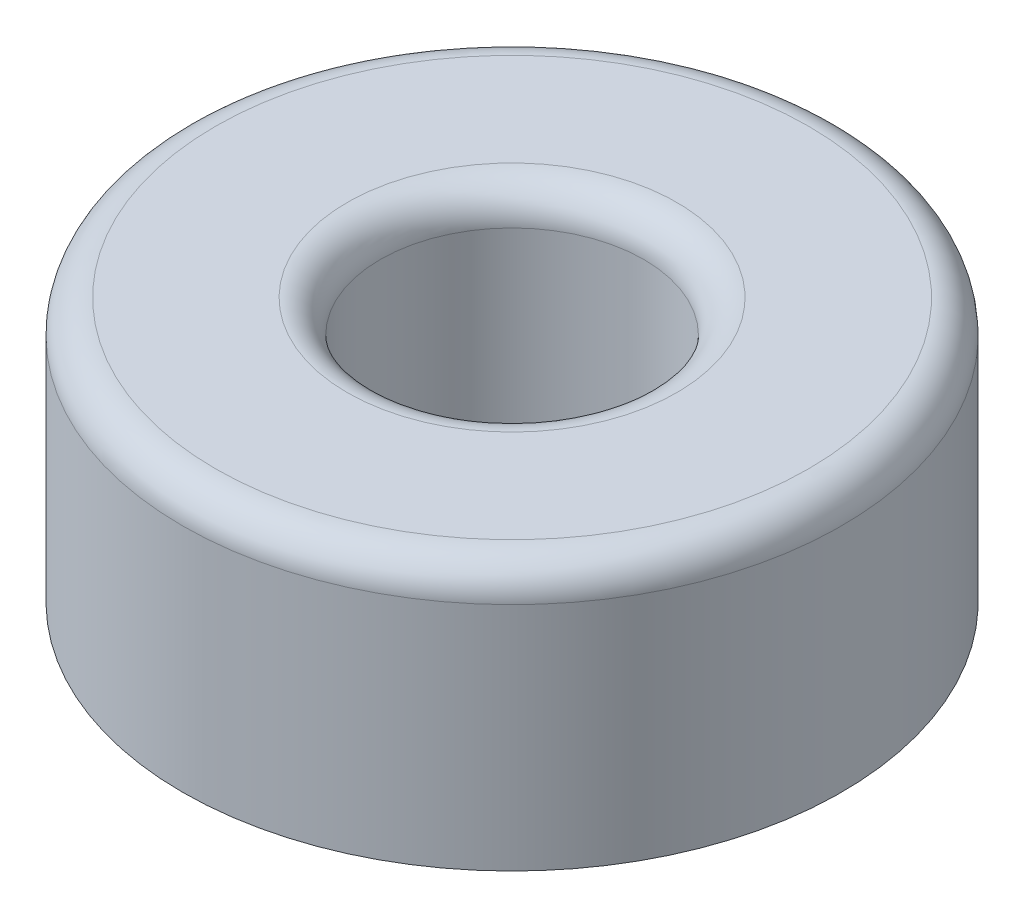
ISO-10303-21;
HEADER;
FILE_DESCRIPTION(('STEP AP214'),'2;1');
FILE_NAME('part.step','',(''),(''),'','','');
FILE_SCHEMA(('AUTOMOTIVE_DESIGN { 1 0 10303 214 1 1 1 1 }'));
ENDSEC;
DATA;
#1=APPLICATION_CONTEXT('core data for automotive mechanical design processes');
#2=APPLICATION_PROTOCOL_DEFINITION('international standard','automotive_design',2000,#1);
#3=PRODUCT_CONTEXT('',#1,'mechanical');
#4=PRODUCT('Part','Part','',(#3));
#5=PRODUCT_RELATED_PRODUCT_CATEGORY('part','',(#4));
#6=PRODUCT_DEFINITION_FORMATION('','',#4);
#7=PRODUCT_DEFINITION_CONTEXT('part definition',#1,'design');
#8=PRODUCT_DEFINITION('design','',#6,#7);
#9=PRODUCT_DEFINITION_SHAPE('','',#8);
#10=(LENGTH_UNIT() NAMED_UNIT(*) SI_UNIT(.MILLI.,.METRE.));
#11=(NAMED_UNIT(*) PLANE_ANGLE_UNIT() SI_UNIT($,.RADIAN.));
#12=(NAMED_UNIT(*) SI_UNIT($,.STERADIAN.) SOLID_ANGLE_UNIT());
#13=UNCERTAINTY_MEASURE_WITH_UNIT(LENGTH_MEASURE(1.E-05),#10,'distance_accuracy_value','');
#14=(GEOMETRIC_REPRESENTATION_CONTEXT(3) GLOBAL_UNCERTAINTY_ASSIGNED_CONTEXT((#13)) GLOBAL_UNIT_ASSIGNED_CONTEXT((#10,
#11,#12)) REPRESENTATION_CONTEXT('',''));
#15=CARTESIAN_POINT('',(0.,0.,0.));
#16=DIRECTION('',(0.,0.,1.));
#17=DIRECTION('',(1.,0.,0.));
#18=AXIS2_PLACEMENT_3D('',#15,#16,#17);
#19=CARTESIAN_POINT('',(0.,4.,0.));
#20=DIRECTION('',(0.,1.,0.));
#21=DIRECTION('',(0.,0.,1.));
#22=AXIS2_PLACEMENT_3D('',#19,#20,#21);
#23=PLANE('',#22);
#24=CARTESIAN_POINT('',(0.,4.,0.));
#25=DIRECTION('',(0.,1.,0.));
#26=DIRECTION('',(0.,0.,1.));
#27=AXIS2_PLACEMENT_3D('',#24,#25,#26);
#28=CIRCLE('',#27,2.5);
#29=CARTESIAN_POINT('',(0.,4.,2.5));
#30=VERTEX_POINT('',#29);
#31=EDGE_CURVE('E39',#30,#30,#28,.F.);
#32=ORIENTED_EDGE('',*,*,#31,.T.);
#33=EDGE_LOOP('',(#32));
#34=FACE_BOUND('',#33,.T.);
#35=CARTESIAN_POINT('',(0.,4.,0.));
#36=DIRECTION('',(0.,1.,0.));
#37=DIRECTION('',(0.,0.,1.));
#38=AXIS2_PLACEMENT_3D('',#35,#36,#37);
#39=CIRCLE('',#38,4.5);
#40=CARTESIAN_POINT('',(0.,4.,4.5));
#41=VERTEX_POINT('',#40);
#42=EDGE_CURVE('E43',#41,#41,#39,.T.);
#43=ORIENTED_EDGE('',*,*,#42,.T.);
#44=EDGE_LOOP('',(#43));
#45=FACE_BOUND('',#44,.T.);
#46=ADVANCED_FACE('F32',(#34,#45),#23,.T.);
#47=CARTESIAN_POINT('',(0.,0.,0.));
#48=DIRECTION('',(0.,1.,0.));
#49=DIRECTION('',(0.,0.,1.));
#50=AXIS2_PLACEMENT_3D('',#47,#48,#49);
#51=PLANE('',#50);
#52=CARTESIAN_POINT('',(0.,0.,0.));
#53=DIRECTION('',(0.,1.,0.));
#54=DIRECTION('',(0.,0.,1.));
#55=AXIS2_PLACEMENT_3D('',#52,#53,#54);
#56=CIRCLE('',#55,5.);
#57=CARTESIAN_POINT('',(0.,0.,5.));
#58=VERTEX_POINT('',#57);
#59=EDGE_CURVE('E52',#58,#58,#56,.T.);
#60=ORIENTED_EDGE('',*,*,#59,.F.);
#61=EDGE_LOOP('',(#60));
#62=FACE_BOUND('',#61,.T.);
#63=CARTESIAN_POINT('',(0.,0.,0.));
#64=DIRECTION('',(0.,1.,0.));
#65=DIRECTION('',(0.,0.,1.));
#66=AXIS2_PLACEMENT_3D('',#63,#64,#65);
#67=CIRCLE('',#66,2.);
#68=CARTESIAN_POINT('',(0.,0.,2.));
#69=VERTEX_POINT('',#68);
#70=EDGE_CURVE('E55',#69,#69,#67,.T.);
#71=ORIENTED_EDGE('',*,*,#70,.T.);
#72=EDGE_LOOP('',(#71));
#73=FACE_BOUND('',#72,.T.);
#74=ADVANCED_FACE('F59',(#62,#73),#51,.F.);
#75=CARTESIAN_POINT('',(0.,4.,0.));
#76=DIRECTION('',(0.,-1.,0.));
#77=DIRECTION('',(0.,0.,-1.));
#78=AXIS2_PLACEMENT_3D('',#75,#76,#77);
#79=CYLINDRICAL_SURFACE('',#78,5.);
#80=CARTESIAN_POINT('',(0.,3.5,0.));
#81=DIRECTION('',(0.,1.,0.));
#82=DIRECTION('',(0.,0.,1.));
#83=AXIS2_PLACEMENT_3D('',#80,#81,#82);
#84=CIRCLE('',#83,5.);
#85=CARTESIAN_POINT('',(0.,3.5,5.));
#86=VERTEX_POINT('',#85);
#87=EDGE_CURVE('E10',#86,#86,#84,.F.);
#88=ORIENTED_EDGE('',*,*,#87,.T.);
#89=EDGE_LOOP('',(#88));
#90=FACE_BOUND('',#89,.T.);
#91=ORIENTED_EDGE('',*,*,#59,.T.);
#92=EDGE_LOOP('',(#91));
#93=FACE_BOUND('',#92,.T.);
#94=ADVANCED_FACE('F64',(#90,#93),#79,.T.);
#95=CARTESIAN_POINT('',(0.,4.,0.));
#96=DIRECTION('',(0.,-1.,0.));
#97=DIRECTION('',(0.,0.,-1.));
#98=AXIS2_PLACEMENT_3D('',#95,#96,#97);
#99=CYLINDRICAL_SURFACE('',#98,2.);
#100=CARTESIAN_POINT('',(0.,3.5,0.));
#101=DIRECTION('',(0.,1.,0.));
#102=DIRECTION('',(0.,0.,1.));
#103=AXIS2_PLACEMENT_3D('',#100,#101,#102);
#104=CIRCLE('',#103,2.);
#105=CARTESIAN_POINT('',(0.,3.5,2.));
#106=VERTEX_POINT('',#105);
#107=EDGE_CURVE('E47',#106,#106,#104,.T.);
#108=ORIENTED_EDGE('',*,*,#107,.T.);
#109=EDGE_LOOP('',(#108));
#110=FACE_BOUND('',#109,.T.);
#111=ORIENTED_EDGE('',*,*,#70,.F.);
#112=EDGE_LOOP('',(#111));
#113=FACE_BOUND('',#112,.T.);
#114=ADVANCED_FACE('F61',(#110,#113),#99,.F.);
#115=CARTESIAN_POINT('',(0.,3.5,0.));
#116=DIRECTION('',(0.,1.,0.));
#117=DIRECTION('',(0.,0.,1.));
#118=AXIS2_PLACEMENT_3D('',#115,#116,#117);
#119=TOROIDAL_SURFACE('',#118,2.5,0.5);
#120=ORIENTED_EDGE('',*,*,#31,.F.);
#121=EDGE_LOOP('',(#120));
#122=FACE_BOUND('',#121,.T.);
#123=ORIENTED_EDGE('',*,*,#107,.F.);
#124=EDGE_LOOP('',(#123));
#125=FACE_BOUND('',#124,.T.);
#126=ADVANCED_FACE('F63',(#122,#125),#119,.T.);
#127=CARTESIAN_POINT('',(0.,3.5,0.));
#128=DIRECTION('',(0.,1.,0.));
#129=DIRECTION('',(0.,0.,1.));
#130=AXIS2_PLACEMENT_3D('',#127,#128,#129);
#131=TOROIDAL_SURFACE('',#130,4.5,0.5);
#132=ORIENTED_EDGE('',*,*,#87,.F.);
#133=EDGE_LOOP('',(#132));
#134=FACE_BOUND('',#133,.T.);
#135=ORIENTED_EDGE('',*,*,#42,.F.);
#136=EDGE_LOOP('',(#135));
#137=FACE_BOUND('',#136,.T.);
#138=ADVANCED_FACE('F34',(#134,#137),#131,.T.);
#139=CLOSED_SHELL('',(#46,#74,#94,#114,#126,#138));
#140=MANIFOLD_SOLID_BREP('B2',#139);
#141=ADVANCED_BREP_SHAPE_REPRESENTATION('',(#18,#140),#14);
#142=SHAPE_DEFINITION_REPRESENTATION(#9,#141);
ENDSEC;
END-ISO-10303-21;
